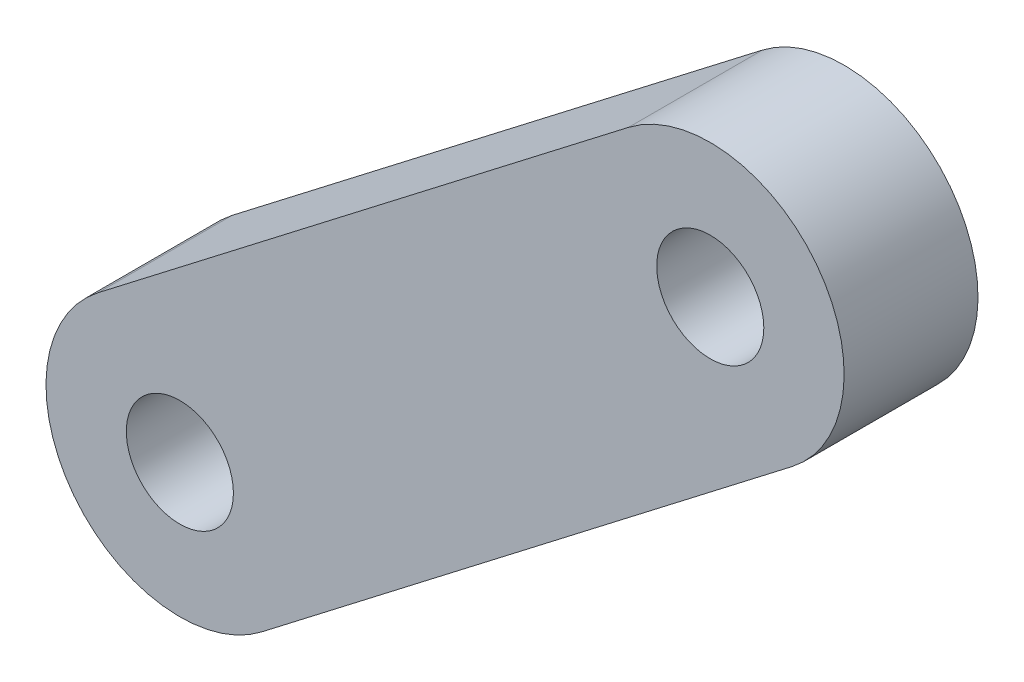
ISO-10303-21;
HEADER;
FILE_DESCRIPTION(('STEP AP214'),'2;1');
FILE_NAME('part.step','',(''),(''),'','','');
FILE_SCHEMA(('AUTOMOTIVE_DESIGN { 1 0 10303 214 1 1 1 1 }'));
ENDSEC;
DATA;
#1=APPLICATION_CONTEXT('core data for automotive mechanical design processes');
#2=APPLICATION_PROTOCOL_DEFINITION('international standard','automotive_design',2000,#1);
#3=PRODUCT_CONTEXT('',#1,'mechanical');
#4=PRODUCT('Part','Part','',(#3));
#5=PRODUCT_RELATED_PRODUCT_CATEGORY('part','',(#4));
#6=PRODUCT_DEFINITION_FORMATION('','',#4);
#7=PRODUCT_DEFINITION_CONTEXT('part definition',#1,'design');
#8=PRODUCT_DEFINITION('design','',#6,#7);
#9=PRODUCT_DEFINITION_SHAPE('','',#8);
#10=(LENGTH_UNIT() NAMED_UNIT(*) SI_UNIT(.MILLI.,.METRE.));
#11=(NAMED_UNIT(*) PLANE_ANGLE_UNIT() SI_UNIT($,.RADIAN.));
#12=(NAMED_UNIT(*) SI_UNIT($,.STERADIAN.) SOLID_ANGLE_UNIT());
#13=UNCERTAINTY_MEASURE_WITH_UNIT(LENGTH_MEASURE(1.E-05),#10,'distance_accuracy_value','');
#14=(GEOMETRIC_REPRESENTATION_CONTEXT(3) GLOBAL_UNCERTAINTY_ASSIGNED_CONTEXT((#13)) GLOBAL_UNIT_ASSIGNED_CONTEXT((#10,
#11,#12)) REPRESENTATION_CONTEXT('',''));
#15=CARTESIAN_POINT('',(0.,0.,0.));
#16=DIRECTION('',(0.,0.,1.));
#17=DIRECTION('',(1.,0.,0.));
#18=AXIS2_PLACEMENT_3D('',#15,#16,#17);
#19=CARTESIAN_POINT('',(-54.4085511361733,70.6633839518424,5.));
#20=DIRECTION('',(-0.610077729525656,0.792341570244058,0.));
#21=DIRECTION('',(-0.792341570244058,-0.610077729525656,0.));
#22=AXIS2_PLACEMENT_3D('',#19,#20,#21);
#23=PLANE('',#22);
#24=DIRECTION('',(0.792341570244058,0.610077729525656,0.));
#25=VECTOR('',#24,1.);
#26=CARTESIAN_POINT('',(-54.4085511361733,70.6633839518424,0.));
#27=LINE('',#26,#25);
#28=CARTESIAN_POINT('',(-41.3297532163879,80.7336410726064,0.));
#29=VERTEX_POINT('',#28);
#30=CARTESIAN_POINT('',(-21.5212139602865,95.9855843107478,0.));
#31=VERTEX_POINT('',#30);
#32=EDGE_CURVE('E101',#29,#31,#27,.T.);
#33=ORIENTED_EDGE('',*,*,#32,.T.);
#34=DIRECTION('',(0.,0.,-1.));
#35=VECTOR('',#34,1.);
#36=CARTESIAN_POINT('',(-21.5212139602865,95.9855843107478,5.));
#37=LINE('',#36,#35);
#38=CARTESIAN_POINT('',(-21.5212139602865,95.9855843107478,5.));
#39=VERTEX_POINT('',#38);
#40=EDGE_CURVE('E11',#39,#31,#37,.T.);
#41=ORIENTED_EDGE('',*,*,#40,.F.);
#42=DIRECTION('',(0.792341570244058,0.610077729525656,0.));
#43=VECTOR('',#42,1.);
#44=CARTESIAN_POINT('',(-54.4085511361733,70.6633839518424,5.));
#45=LINE('',#44,#43);
#46=CARTESIAN_POINT('',(-41.3297532163879,80.7336410726064,5.));
#47=VERTEX_POINT('',#46);
#48=EDGE_CURVE('E80',#47,#39,#45,.T.);
#49=ORIENTED_EDGE('',*,*,#48,.F.);
#50=DIRECTION('',(0.,0.,-1.));
#51=VECTOR('',#50,1.);
#52=CARTESIAN_POINT('',(-41.3297532163879,80.7336410726064,5.));
#53=LINE('',#52,#51);
#54=EDGE_CURVE('E91',#47,#29,#53,.T.);
#55=ORIENTED_EDGE('',*,*,#54,.T.);
#56=EDGE_LOOP('',(#33,#41,#49,#55));
#57=FACE_BOUND('',#56,.T.);
#58=ADVANCED_FACE('F32',(#57),#23,.F.);
#59=CARTESIAN_POINT('',(-24.5716026079148,99.9472921619681,5.));
#60=DIRECTION('',(0.,0.,-1.));
#61=DIRECTION('',(-1.,0.,0.));
#62=AXIS2_PLACEMENT_3D('',#59,#60,#61);
#63=CYLINDRICAL_SURFACE('',#62,5.00000000000002);
#64=CARTESIAN_POINT('',(-24.5716026079148,99.9472921619681,0.));
#65=DIRECTION('',(0.,0.,1.));
#66=DIRECTION('',(1.,0.,0.));
#67=AXIS2_PLACEMENT_3D('',#64,#65,#66);
#68=CIRCLE('',#67,5.00000000000002);
#69=CARTESIAN_POINT('',(-27.6219912555431,103.909000013188,0.));
#70=VERTEX_POINT('',#69);
#71=EDGE_CURVE('E85',#31,#70,#68,.T.);
#72=ORIENTED_EDGE('',*,*,#71,.T.);
#73=DIRECTION('',(0.,0.,-1.));
#74=VECTOR('',#73,1.);
#75=CARTESIAN_POINT('',(-27.6219912555431,103.909000013188,5.));
#76=LINE('',#75,#74);
#77=CARTESIAN_POINT('',(-27.6219912555431,103.909000013188,5.));
#78=VERTEX_POINT('',#77);
#79=EDGE_CURVE('E41',#78,#70,#76,.T.);
#80=ORIENTED_EDGE('',*,*,#79,.F.);
#81=CARTESIAN_POINT('',(-24.5716026079148,99.9472921619681,5.));
#82=DIRECTION('',(0.,0.,1.));
#83=DIRECTION('',(1.,0.,0.));
#84=AXIS2_PLACEMENT_3D('',#81,#82,#83);
#85=CIRCLE('',#84,5.00000000000002);
#86=EDGE_CURVE('E75',#39,#78,#85,.T.);
#87=ORIENTED_EDGE('',*,*,#86,.F.);
#88=ORIENTED_EDGE('',*,*,#40,.T.);
#89=EDGE_LOOP('',(#72,#80,#87,#88));
#90=FACE_BOUND('',#89,.T.);
#91=ADVANCED_FACE('F84',(#90),#63,.T.);
#92=CARTESIAN_POINT('',(-60.50932843143,78.5867996542829,5.));
#93=DIRECTION('',(-0.610077729525657,0.792341570244058,0.));
#94=DIRECTION('',(-0.792341570244058,-0.610077729525657,0.));
#95=AXIS2_PLACEMENT_3D('',#92,#93,#94);
#96=PLANE('',#95);
#97=DIRECTION('',(0.792341570244058,0.610077729525657,0.));
#98=VECTOR('',#97,1.);
#99=CARTESIAN_POINT('',(-60.50932843143,78.5867996542829,0.));
#100=LINE('',#99,#98);
#101=CARTESIAN_POINT('',(-47.4305305116445,88.657056775047,0.));
#102=VERTEX_POINT('',#101);
#103=EDGE_CURVE('E105',#102,#70,#100,.T.);
#104=ORIENTED_EDGE('',*,*,#103,.F.);
#105=DIRECTION('',(0.,0.,-1.));
#106=VECTOR('',#105,1.);
#107=CARTESIAN_POINT('',(-47.4305305116445,88.657056775047,5.));
#108=LINE('',#107,#106);
#109=CARTESIAN_POINT('',(-47.4305305116445,88.657056775047,5.));
#110=VERTEX_POINT('',#109);
#111=EDGE_CURVE('E65',#110,#102,#108,.T.);
#112=ORIENTED_EDGE('',*,*,#111,.F.);
#113=DIRECTION('',(0.792341570244058,0.610077729525657,0.));
#114=VECTOR('',#113,1.);
#115=CARTESIAN_POINT('',(-60.50932843143,78.5867996542829,5.));
#116=LINE('',#115,#114);
#117=EDGE_CURVE('E78',#110,#78,#116,.T.);
#118=ORIENTED_EDGE('',*,*,#117,.T.);
#119=ORIENTED_EDGE('',*,*,#79,.T.);
#120=EDGE_LOOP('',(#104,#112,#118,#119));
#121=FACE_BOUND('',#120,.T.);
#122=ADVANCED_FACE('F89',(#121),#96,.T.);
#123=CARTESIAN_POINT('',(-44.3801418640162,84.6953489238267,5.));
#124=DIRECTION('',(0.,0.,-1.));
#125=DIRECTION('',(-1.,0.,0.));
#126=AXIS2_PLACEMENT_3D('',#123,#124,#125);
#127=CYLINDRICAL_SURFACE('',#126,2.);
#128=CARTESIAN_POINT('',(-44.3801418640162,84.6953489238267,5.));
#129=DIRECTION('',(0.,0.,1.));
#130=DIRECTION('',(1.,0.,0.));
#131=AXIS2_PLACEMENT_3D('',#128,#129,#130);
#132=CIRCLE('',#131,2.);
#133=CARTESIAN_POINT('',(-42.3801418640162,84.6953489238267,5.));
#134=VERTEX_POINT('',#133);
#135=EDGE_CURVE('E143',#134,#134,#132,.T.);
#136=ORIENTED_EDGE('',*,*,#135,.T.);
#137=EDGE_LOOP('',(#136));
#138=FACE_BOUND('',#137,.T.);
#139=CARTESIAN_POINT('',(-44.3801418640162,84.6953489238267,0.));
#140=DIRECTION('',(0.,0.,1.));
#141=DIRECTION('',(1.,0.,0.));
#142=AXIS2_PLACEMENT_3D('',#139,#140,#141);
#143=CIRCLE('',#142,2.);
#144=CARTESIAN_POINT('',(-42.3801418640162,84.6953489238267,0.));
#145=VERTEX_POINT('',#144);
#146=EDGE_CURVE('E98',#145,#145,#143,.T.);
#147=ORIENTED_EDGE('',*,*,#146,.F.);
#148=EDGE_LOOP('',(#147));
#149=FACE_BOUND('',#148,.T.);
#150=ADVANCED_FACE('F132',(#138,#149),#127,.F.);
#151=CARTESIAN_POINT('',(-24.5716026079148,99.9472921619681,5.));
#152=DIRECTION('',(0.,0.,-1.));
#153=DIRECTION('',(-1.,0.,0.));
#154=AXIS2_PLACEMENT_3D('',#151,#152,#153);
#155=CYLINDRICAL_SURFACE('',#154,2.00000000000001);
#156=CARTESIAN_POINT('',(-24.5716026079148,99.9472921619681,5.));
#157=DIRECTION('',(0.,0.,1.));
#158=DIRECTION('',(1.,0.,0.));
#159=AXIS2_PLACEMENT_3D('',#156,#157,#158);
#160=CIRCLE('',#159,2.00000000000001);
#161=CARTESIAN_POINT('',(-22.5716026079148,99.9472921619681,5.));
#162=VERTEX_POINT('',#161);
#163=EDGE_CURVE('E108',#162,#162,#160,.T.);
#164=ORIENTED_EDGE('',*,*,#163,.T.);
#165=EDGE_LOOP('',(#164));
#166=FACE_BOUND('',#165,.T.);
#167=CARTESIAN_POINT('',(-24.5716026079148,99.9472921619681,0.));
#168=DIRECTION('',(0.,0.,1.));
#169=DIRECTION('',(1.,0.,0.));
#170=AXIS2_PLACEMENT_3D('',#167,#168,#169);
#171=CIRCLE('',#170,2.00000000000001);
#172=CARTESIAN_POINT('',(-22.5716026079148,99.9472921619681,0.));
#173=VERTEX_POINT('',#172);
#174=EDGE_CURVE('E95',#173,#173,#171,.T.);
#175=ORIENTED_EDGE('',*,*,#174,.F.);
#176=EDGE_LOOP('',(#175));
#177=FACE_BOUND('',#176,.T.);
#178=ADVANCED_FACE('F34',(#166,#177),#155,.F.);
#179=CARTESIAN_POINT('',(-44.3801418640162,84.6953489238267,5.));
#180=DIRECTION('',(0.,0.,-1.));
#181=DIRECTION('',(-1.,0.,0.));
#182=AXIS2_PLACEMENT_3D('',#179,#180,#181);
#183=CYLINDRICAL_SURFACE('',#182,5.);
#184=CARTESIAN_POINT('',(-44.3801418640162,84.6953489238267,0.));
#185=DIRECTION('',(0.,0.,1.));
#186=DIRECTION('',(1.,0.,0.));
#187=AXIS2_PLACEMENT_3D('',#184,#185,#186);
#188=CIRCLE('',#187,5.);
#189=EDGE_CURVE('E68',#102,#29,#188,.T.);
#190=ORIENTED_EDGE('',*,*,#189,.T.);
#191=ORIENTED_EDGE('',*,*,#54,.F.);
#192=CARTESIAN_POINT('',(-44.3801418640162,84.6953489238267,5.));
#193=DIRECTION('',(0.,0.,1.));
#194=DIRECTION('',(1.,0.,0.));
#195=AXIS2_PLACEMENT_3D('',#192,#193,#194);
#196=CIRCLE('',#195,5.);
#197=EDGE_CURVE('E49',#110,#47,#196,.T.);
#198=ORIENTED_EDGE('',*,*,#197,.F.);
#199=ORIENTED_EDGE('',*,*,#111,.T.);
#200=EDGE_LOOP('',(#190,#191,#198,#199));
#201=FACE_BOUND('',#200,.T.);
#202=ADVANCED_FACE('F120',(#201),#183,.T.);
#203=CARTESIAN_POINT('',(0.,0.,5.));
#204=DIRECTION('',(0.,0.,1.));
#205=DIRECTION('',(1.,0.,0.));
#206=AXIS2_PLACEMENT_3D('',#203,#204,#205);
#207=PLANE('',#206);
#208=ORIENTED_EDGE('',*,*,#163,.F.);
#209=EDGE_LOOP('',(#208));
#210=FACE_BOUND('',#209,.T.);
#211=ORIENTED_EDGE('',*,*,#135,.F.);
#212=EDGE_LOOP('',(#211));
#213=FACE_BOUND('',#212,.T.);
#214=ORIENTED_EDGE('',*,*,#48,.T.);
#215=ORIENTED_EDGE('',*,*,#86,.T.);
#216=ORIENTED_EDGE('',*,*,#117,.F.);
#217=ORIENTED_EDGE('',*,*,#197,.T.);
#218=EDGE_LOOP('',(#214,#215,#216,#217));
#219=FACE_BOUND('',#218,.T.);
#220=ADVANCED_FACE('F76',(#210,#213,#219),#207,.T.);
#221=CARTESIAN_POINT('',(0.,0.,0.));
#222=DIRECTION('',(0.,0.,1.));
#223=DIRECTION('',(1.,0.,0.));
#224=AXIS2_PLACEMENT_3D('',#221,#222,#223);
#225=PLANE('',#224);
#226=ORIENTED_EDGE('',*,*,#174,.T.);
#227=EDGE_LOOP('',(#226));
#228=FACE_BOUND('',#227,.T.);
#229=ORIENTED_EDGE('',*,*,#146,.T.);
#230=EDGE_LOOP('',(#229));
#231=FACE_BOUND('',#230,.T.);
#232=ORIENTED_EDGE('',*,*,#32,.F.);
#233=ORIENTED_EDGE('',*,*,#189,.F.);
#234=ORIENTED_EDGE('',*,*,#103,.T.);
#235=ORIENTED_EDGE('',*,*,#71,.F.);
#236=EDGE_LOOP('',(#232,#233,#234,#235));
#237=FACE_BOUND('',#236,.T.);
#238=ADVANCED_FACE('F113',(#228,#231,#237),#225,.F.);
#239=CLOSED_SHELL('',(#58,#91,#122,#150,#178,#202,#220,#238));
#240=MANIFOLD_SOLID_BREP('B2',#239);
#241=ADVANCED_BREP_SHAPE_REPRESENTATION('',(#18,#240),#14);
#242=SHAPE_DEFINITION_REPRESENTATION(#9,#241);
ENDSEC;
END-ISO-10303-21;
